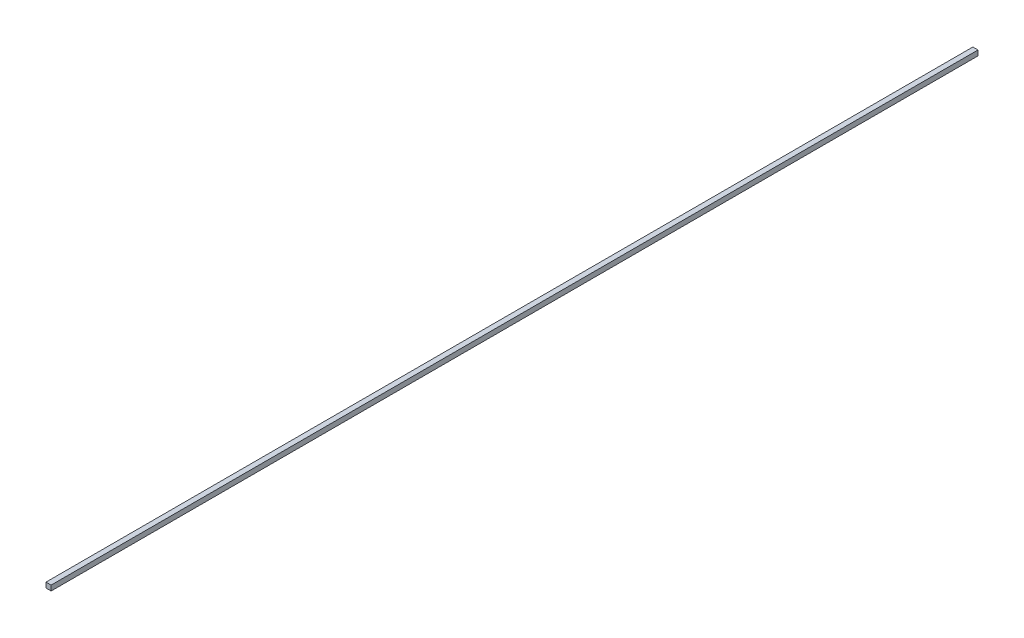
ISO-10303-21;
HEADER;
FILE_DESCRIPTION(('STEP AP214'),'2;1');
FILE_NAME('part.step','',(''),(''),'','','');
FILE_SCHEMA(('AUTOMOTIVE_DESIGN { 1 0 10303 214 1 1 1 1 }'));
ENDSEC;
DATA;
#1=APPLICATION_CONTEXT('core data for automotive mechanical design processes');
#2=APPLICATION_PROTOCOL_DEFINITION('international standard','automotive_design',2000,#1);
#3=PRODUCT_CONTEXT('',#1,'mechanical');
#4=PRODUCT('Part','Part','',(#3));
#5=PRODUCT_RELATED_PRODUCT_CATEGORY('part','',(#4));
#6=PRODUCT_DEFINITION_FORMATION('','',#4);
#7=PRODUCT_DEFINITION_CONTEXT('part definition',#1,'design');
#8=PRODUCT_DEFINITION('design','',#6,#7);
#9=PRODUCT_DEFINITION_SHAPE('','',#8);
#10=(LENGTH_UNIT() NAMED_UNIT(*) SI_UNIT(.MILLI.,.METRE.));
#11=(NAMED_UNIT(*) PLANE_ANGLE_UNIT() SI_UNIT($,.RADIAN.));
#12=(NAMED_UNIT(*) SI_UNIT($,.STERADIAN.) SOLID_ANGLE_UNIT());
#13=UNCERTAINTY_MEASURE_WITH_UNIT(LENGTH_MEASURE(1.E-05),#10,'distance_accuracy_value','');
#14=(GEOMETRIC_REPRESENTATION_CONTEXT(3) GLOBAL_UNCERTAINTY_ASSIGNED_CONTEXT((#13)) GLOBAL_UNIT_ASSIGNED_CONTEXT((#10,
#11,#12)) REPRESENTATION_CONTEXT('',''));
#15=CARTESIAN_POINT('',(0.,0.,0.));
#16=DIRECTION('',(0.,0.,1.));
#17=DIRECTION('',(1.,0.,0.));
#18=AXIS2_PLACEMENT_3D('',#15,#16,#17);
#19=CARTESIAN_POINT('',(5.,5.,1800.));
#20=DIRECTION('',(-1.,0.,0.));
#21=DIRECTION('',(0.,0.,1.));
#22=AXIS2_PLACEMENT_3D('',#19,#20,#21);
#23=PLANE('',#22);
#24=DIRECTION('',(0.,1.,0.));
#25=VECTOR('',#24,1.);
#26=CARTESIAN_POINT('',(5.,5.,0.));
#27=LINE('',#26,#25);
#28=CARTESIAN_POINT('',(5.,-5.,0.));
#29=VERTEX_POINT('',#28);
#30=CARTESIAN_POINT('',(5.,5.,0.));
#31=VERTEX_POINT('',#30);
#32=EDGE_CURVE('E105',#29,#31,#27,.T.);
#33=ORIENTED_EDGE('',*,*,#32,.T.);
#34=DIRECTION('',(0.,0.,-1.));
#35=VECTOR('',#34,1.);
#36=CARTESIAN_POINT('',(5.,5.,1800.));
#37=LINE('',#36,#35);
#38=CARTESIAN_POINT('',(5.,5.,1800.));
#39=VERTEX_POINT('',#38);
#40=EDGE_CURVE('E11',#39,#31,#37,.T.);
#41=ORIENTED_EDGE('',*,*,#40,.F.);
#42=DIRECTION('',(0.,1.,0.));
#43=VECTOR('',#42,1.);
#44=CARTESIAN_POINT('',(5.,5.,1800.));
#45=LINE('',#44,#43);
#46=CARTESIAN_POINT('',(5.,-5.,1800.));
#47=VERTEX_POINT('',#46);
#48=EDGE_CURVE('E88',#47,#39,#45,.T.);
#49=ORIENTED_EDGE('',*,*,#48,.F.);
#50=DIRECTION('',(0.,0.,-1.));
#51=VECTOR('',#50,1.);
#52=CARTESIAN_POINT('',(5.,-5.,1800.));
#53=LINE('',#52,#51);
#54=EDGE_CURVE('E101',#47,#29,#53,.T.);
#55=ORIENTED_EDGE('',*,*,#54,.T.);
#56=EDGE_LOOP('',(#33,#41,#49,#55));
#57=FACE_BOUND('',#56,.T.);
#58=ADVANCED_FACE('F36',(#57),#23,.F.);
#59=CARTESIAN_POINT('',(-5.,5.,1800.));
#60=DIRECTION('',(0.,-1.,0.));
#61=DIRECTION('',(0.,0.,-1.));
#62=AXIS2_PLACEMENT_3D('',#59,#60,#61);
#63=PLANE('',#62);
#64=DIRECTION('',(-1.,0.,0.));
#65=VECTOR('',#64,1.);
#66=CARTESIAN_POINT('',(-5.,5.,0.));
#67=LINE('',#66,#65);
#68=CARTESIAN_POINT('',(-5.,5.,0.));
#69=VERTEX_POINT('',#68);
#70=EDGE_CURVE('E93',#31,#69,#67,.T.);
#71=ORIENTED_EDGE('',*,*,#70,.T.);
#72=DIRECTION('',(0.,0.,-1.));
#73=VECTOR('',#72,1.);
#74=CARTESIAN_POINT('',(-5.,5.,1800.));
#75=LINE('',#74,#73);
#76=CARTESIAN_POINT('',(-5.,5.,1800.));
#77=VERTEX_POINT('',#76);
#78=EDGE_CURVE('E45',#77,#69,#75,.T.);
#79=ORIENTED_EDGE('',*,*,#78,.F.);
#80=DIRECTION('',(-1.,0.,0.));
#81=VECTOR('',#80,1.);
#82=CARTESIAN_POINT('',(-5.,5.,1800.));
#83=LINE('',#82,#81);
#84=EDGE_CURVE('E83',#39,#77,#83,.T.);
#85=ORIENTED_EDGE('',*,*,#84,.F.);
#86=ORIENTED_EDGE('',*,*,#40,.T.);
#87=EDGE_LOOP('',(#71,#79,#85,#86));
#88=FACE_BOUND('',#87,.T.);
#89=ADVANCED_FACE('F92',(#88),#63,.F.);
#90=CARTESIAN_POINT('',(-5.,5.,1800.));
#91=DIRECTION('',(1.,0.,0.));
#92=DIRECTION('',(0.,1.,0.));
#93=AXIS2_PLACEMENT_3D('',#90,#91,#92);
#94=PLANE('',#93);
#95=DIRECTION('',(0.,-1.,0.));
#96=VECTOR('',#95,1.);
#97=CARTESIAN_POINT('',(-5.,5.,0.));
#98=LINE('',#97,#96);
#99=CARTESIAN_POINT('',(-5.,-5.,0.));
#100=VERTEX_POINT('',#99);
#101=EDGE_CURVE('E70',#69,#100,#98,.T.);
#102=ORIENTED_EDGE('',*,*,#101,.T.);
#103=DIRECTION('',(0.,0.,-1.));
#104=VECTOR('',#103,1.);
#105=CARTESIAN_POINT('',(-5.,-5.,1800.));
#106=LINE('',#105,#104);
#107=CARTESIAN_POINT('',(-5.,-5.,1800.));
#108=VERTEX_POINT('',#107);
#109=EDGE_CURVE('E95',#108,#100,#106,.T.);
#110=ORIENTED_EDGE('',*,*,#109,.F.);
#111=DIRECTION('',(0.,-1.,0.));
#112=VECTOR('',#111,1.);
#113=CARTESIAN_POINT('',(-5.,5.,1800.));
#114=LINE('',#113,#112);
#115=EDGE_CURVE('E86',#77,#108,#114,.T.);
#116=ORIENTED_EDGE('',*,*,#115,.F.);
#117=ORIENTED_EDGE('',*,*,#78,.T.);
#118=EDGE_LOOP('',(#102,#110,#116,#117));
#119=FACE_BOUND('',#118,.T.);
#120=ADVANCED_FACE('F96',(#119),#94,.F.);
#121=CARTESIAN_POINT('',(-5.,-5.,1800.));
#122=DIRECTION('',(0.,1.,0.));
#123=DIRECTION('',(0.,0.,1.));
#124=AXIS2_PLACEMENT_3D('',#121,#122,#123);
#125=PLANE('',#124);
#126=DIRECTION('',(1.,0.,0.));
#127=VECTOR('',#126,1.);
#128=CARTESIAN_POINT('',(-5.,-5.,0.));
#129=LINE('',#128,#127);
#130=EDGE_CURVE('E76',#100,#29,#129,.T.);
#131=ORIENTED_EDGE('',*,*,#130,.T.);
#132=ORIENTED_EDGE('',*,*,#54,.F.);
#133=DIRECTION('',(1.,0.,0.));
#134=VECTOR('',#133,1.);
#135=CARTESIAN_POINT('',(-5.,-5.,1800.));
#136=LINE('',#135,#134);
#137=EDGE_CURVE('E53',#108,#47,#136,.T.);
#138=ORIENTED_EDGE('',*,*,#137,.F.);
#139=ORIENTED_EDGE('',*,*,#109,.T.);
#140=EDGE_LOOP('',(#131,#132,#138,#139));
#141=FACE_BOUND('',#140,.T.);
#142=ADVANCED_FACE('F119',(#141),#125,.F.);
#143=CARTESIAN_POINT('',(0.,0.,1800.));
#144=DIRECTION('',(0.,0.,1.));
#145=DIRECTION('',(1.,0.,0.));
#146=AXIS2_PLACEMENT_3D('',#143,#144,#145);
#147=PLANE('',#146);
#148=ORIENTED_EDGE('',*,*,#48,.T.);
#149=ORIENTED_EDGE('',*,*,#84,.T.);
#150=ORIENTED_EDGE('',*,*,#115,.T.);
#151=ORIENTED_EDGE('',*,*,#137,.T.);
#152=EDGE_LOOP('',(#148,#149,#150,#151));
#153=FACE_BOUND('',#152,.T.);
#154=ADVANCED_FACE('F84',(#153),#147,.T.);
#155=CARTESIAN_POINT('',(0.,0.,0.));
#156=DIRECTION('',(0.,0.,1.));
#157=DIRECTION('',(1.,0.,0.));
#158=AXIS2_PLACEMENT_3D('',#155,#156,#157);
#159=PLANE('',#158);
#160=ORIENTED_EDGE('',*,*,#32,.F.);
#161=ORIENTED_EDGE('',*,*,#130,.F.);
#162=ORIENTED_EDGE('',*,*,#101,.F.);
#163=ORIENTED_EDGE('',*,*,#70,.F.);
#164=EDGE_LOOP('',(#160,#161,#162,#163));
#165=FACE_BOUND('',#164,.T.);
#166=ADVANCED_FACE('F122',(#165),#159,.F.);
#167=CLOSED_SHELL('',(#58,#89,#120,#142,#154,#166));
#168=MANIFOLD_SOLID_BREP('B2',#167);
#169=ADVANCED_BREP_SHAPE_REPRESENTATION('',(#18,#168),#14);
#170=SHAPE_DEFINITION_REPRESENTATION(#9,#169);
ENDSEC;
END-ISO-10303-21;
